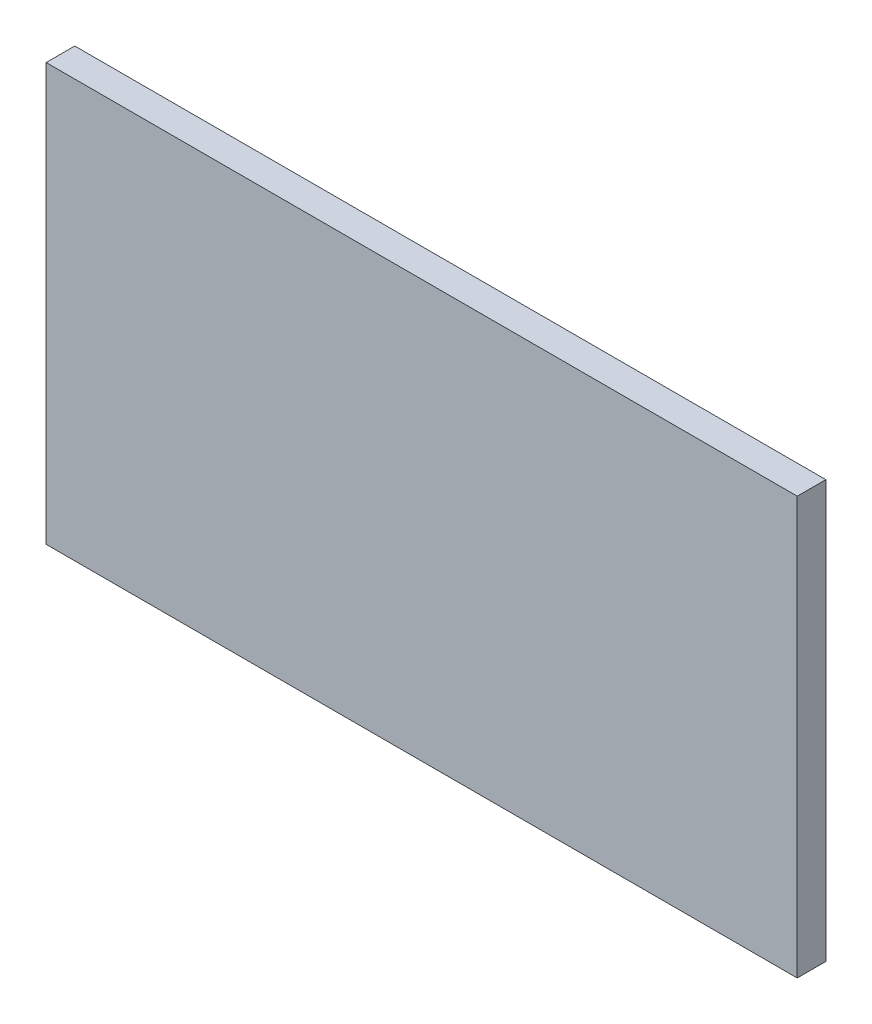
ISO-10303-21;
HEADER;
FILE_DESCRIPTION(('STEP AP214'),'2;1');
FILE_NAME('part.step','',(''),(''),'','','');
FILE_SCHEMA(('AUTOMOTIVE_DESIGN { 1 0 10303 214 1 1 1 1 }'));
ENDSEC;
DATA;
#1=APPLICATION_CONTEXT('core data for automotive mechanical design processes');
#2=APPLICATION_PROTOCOL_DEFINITION('international standard','automotive_design',2000,#1);
#3=PRODUCT_CONTEXT('',#1,'mechanical');
#4=PRODUCT('Part','Part','',(#3));
#5=PRODUCT_RELATED_PRODUCT_CATEGORY('part','',(#4));
#6=PRODUCT_DEFINITION_FORMATION('','',#4);
#7=PRODUCT_DEFINITION_CONTEXT('part definition',#1,'design');
#8=PRODUCT_DEFINITION('design','',#6,#7);
#9=PRODUCT_DEFINITION_SHAPE('','',#8);
#10=(LENGTH_UNIT() NAMED_UNIT(*) SI_UNIT(.MILLI.,.METRE.));
#11=(NAMED_UNIT(*) PLANE_ANGLE_UNIT() SI_UNIT($,.RADIAN.));
#12=(NAMED_UNIT(*) SI_UNIT($,.STERADIAN.) SOLID_ANGLE_UNIT());
#13=UNCERTAINTY_MEASURE_WITH_UNIT(LENGTH_MEASURE(1.E-05),#10,'distance_accuracy_value','');
#14=(GEOMETRIC_REPRESENTATION_CONTEXT(3) GLOBAL_UNCERTAINTY_ASSIGNED_CONTEXT((#13)) GLOBAL_UNIT_ASSIGNED_CONTEXT((#10,
#11,#12)) REPRESENTATION_CONTEXT('',''));
#15=CARTESIAN_POINT('',(0.,0.,0.));
#16=DIRECTION('',(0.,0.,1.));
#17=DIRECTION('',(1.,0.,0.));
#18=AXIS2_PLACEMENT_3D('',#15,#16,#17);
#19=CARTESIAN_POINT('',(0.70008,5.6,0.));
#20=DIRECTION('',(0.,0.,-1.));
#21=DIRECTION('',(-1.,0.,0.));
#22=AXIS2_PLACEMENT_3D('',#19,#20,#21);
#23=PLANE('',#22);
#24=DIRECTION('',(1.,0.,0.));
#25=VECTOR('',#24,1.);
#26=CARTESIAN_POINT('',(0.25008,5.85,0.));
#27=LINE('',#26,#25);
#28=CARTESIAN_POINT('',(0.25008,5.85,0.));
#29=VERTEX_POINT('',#28);
#30=CARTESIAN_POINT('',(1.15008,5.85,0.));
#31=VERTEX_POINT('',#30);
#32=EDGE_CURVE('E55',#29,#31,#27,.T.);
#33=ORIENTED_EDGE('',*,*,#32,.T.);
#34=DIRECTION('',(0.,1.,0.));
#35=VECTOR('',#34,1.);
#36=CARTESIAN_POINT('',(1.15008,5.85,0.));
#37=LINE('',#36,#35);
#38=CARTESIAN_POINT('',(1.15008,5.35,0.));
#39=VERTEX_POINT('',#38);
#40=EDGE_CURVE('E57',#31,#39,#37,.F.);
#41=ORIENTED_EDGE('',*,*,#40,.T.);
#42=DIRECTION('',(1.,0.,0.));
#43=VECTOR('',#42,1.);
#44=CARTESIAN_POINT('',(1.15008,5.35,0.));
#45=LINE('',#44,#43);
#46=CARTESIAN_POINT('',(0.25008,5.35,0.));
#47=VERTEX_POINT('',#46);
#48=EDGE_CURVE('E20',#39,#47,#45,.F.);
#49=ORIENTED_EDGE('',*,*,#48,.T.);
#50=DIRECTION('',(0.,1.,0.));
#51=VECTOR('',#50,1.);
#52=CARTESIAN_POINT('',(0.25008,5.35,0.));
#53=LINE('',#52,#51);
#54=EDGE_CURVE('E80',#47,#29,#53,.T.);
#55=ORIENTED_EDGE('',*,*,#54,.T.);
#56=EDGE_LOOP('',(#33,#41,#49,#55));
#57=FACE_BOUND('',#56,.T.);
#58=ADVANCED_FACE('F17',(#57),#23,.T.);
#59=CARTESIAN_POINT('',(1.15008,5.35,0.));
#60=DIRECTION('',(0.,1.,0.));
#61=DIRECTION('',(0.,0.,1.));
#62=AXIS2_PLACEMENT_3D('',#59,#60,#61);
#63=PLANE('',#62);
#64=DIRECTION('',(0.,0.,-1.));
#65=VECTOR('',#64,1.);
#66=CARTESIAN_POINT('',(0.25008,5.35,0.));
#67=LINE('',#66,#65);
#68=CARTESIAN_POINT('',(0.25008,5.35,0.03429));
#69=VERTEX_POINT('',#68);
#70=EDGE_CURVE('E68',#69,#47,#67,.T.);
#71=ORIENTED_EDGE('',*,*,#70,.T.);
#72=ORIENTED_EDGE('',*,*,#48,.F.);
#73=DIRECTION('',(0.,0.,1.));
#74=VECTOR('',#73,1.);
#75=CARTESIAN_POINT('',(1.15008,5.35,0.));
#76=LINE('',#75,#74);
#77=CARTESIAN_POINT('',(1.15008,5.35,0.03429));
#78=VERTEX_POINT('',#77);
#79=EDGE_CURVE('E63',#39,#78,#76,.T.);
#80=ORIENTED_EDGE('',*,*,#79,.T.);
#81=DIRECTION('',(1.,0.,0.));
#82=VECTOR('',#81,1.);
#83=CARTESIAN_POINT('',(0.70008,5.35,0.03429));
#84=LINE('',#83,#82);
#85=EDGE_CURVE('E83',#69,#78,#84,.T.);
#86=ORIENTED_EDGE('',*,*,#85,.F.);
#87=EDGE_LOOP('',(#71,#72,#80,#86));
#88=FACE_BOUND('',#87,.T.);
#89=ADVANCED_FACE('F65',(#88),#63,.F.);
#90=CARTESIAN_POINT('',(1.15008,5.85,0.));
#91=DIRECTION('',(-1.,0.,0.));
#92=DIRECTION('',(0.,0.,1.));
#93=AXIS2_PLACEMENT_3D('',#90,#91,#92);
#94=PLANE('',#93);
#95=ORIENTED_EDGE('',*,*,#79,.F.);
#96=ORIENTED_EDGE('',*,*,#40,.F.);
#97=DIRECTION('',(0.,0.,-1.));
#98=VECTOR('',#97,1.);
#99=CARTESIAN_POINT('',(1.15008,5.85,0.));
#100=LINE('',#99,#98);
#101=CARTESIAN_POINT('',(1.15008,5.85,0.03429));
#102=VERTEX_POINT('',#101);
#103=EDGE_CURVE('E75',#31,#102,#100,.F.);
#104=ORIENTED_EDGE('',*,*,#103,.T.);
#105=DIRECTION('',(0.,1.,0.));
#106=VECTOR('',#105,1.);
#107=CARTESIAN_POINT('',(1.15008,5.6,0.03429));
#108=LINE('',#107,#106);
#109=EDGE_CURVE('E72',#78,#102,#108,.T.);
#110=ORIENTED_EDGE('',*,*,#109,.F.);
#111=EDGE_LOOP('',(#95,#96,#104,#110));
#112=FACE_BOUND('',#111,.T.);
#113=ADVANCED_FACE('F70',(#112),#94,.F.);
#114=CARTESIAN_POINT('',(0.25008,5.85,0.));
#115=DIRECTION('',(0.,-1.,0.));
#116=DIRECTION('',(0.,0.,-1.));
#117=AXIS2_PLACEMENT_3D('',#114,#115,#116);
#118=PLANE('',#117);
#119=ORIENTED_EDGE('',*,*,#103,.F.);
#120=ORIENTED_EDGE('',*,*,#32,.F.);
#121=DIRECTION('',(0.,0.,-1.));
#122=VECTOR('',#121,1.);
#123=CARTESIAN_POINT('',(0.25008,5.85,0.));
#124=LINE('',#123,#122);
#125=CARTESIAN_POINT('',(0.25008,5.85,0.03429));
#126=VERTEX_POINT('',#125);
#127=EDGE_CURVE('E35',#29,#126,#124,.F.);
#128=ORIENTED_EDGE('',*,*,#127,.T.);
#129=DIRECTION('',(1.,0.,0.));
#130=VECTOR('',#129,1.);
#131=CARTESIAN_POINT('',(0.70008,5.85,0.03429));
#132=LINE('',#131,#130);
#133=EDGE_CURVE('E26',#102,#126,#132,.F.);
#134=ORIENTED_EDGE('',*,*,#133,.F.);
#135=EDGE_LOOP('',(#119,#120,#128,#134));
#136=FACE_BOUND('',#135,.T.);
#137=ADVANCED_FACE('F89',(#136),#118,.F.);
#138=CARTESIAN_POINT('',(0.25008,5.35,0.));
#139=DIRECTION('',(1.,0.,0.));
#140=DIRECTION('',(0.,0.,-1.));
#141=AXIS2_PLACEMENT_3D('',#138,#139,#140);
#142=PLANE('',#141);
#143=ORIENTED_EDGE('',*,*,#127,.F.);
#144=ORIENTED_EDGE('',*,*,#54,.F.);
#145=ORIENTED_EDGE('',*,*,#70,.F.);
#146=DIRECTION('',(0.,1.,0.));
#147=VECTOR('',#146,1.);
#148=CARTESIAN_POINT('',(0.25008,5.6,0.03429));
#149=LINE('',#148,#147);
#150=EDGE_CURVE('E11',#126,#69,#149,.F.);
#151=ORIENTED_EDGE('',*,*,#150,.F.);
#152=EDGE_LOOP('',(#143,#144,#145,#151));
#153=FACE_BOUND('',#152,.T.);
#154=ADVANCED_FACE('F91',(#153),#142,.F.);
#155=CARTESIAN_POINT('',(0.70008,5.6,0.03429));
#156=DIRECTION('',(0.,0.,1.));
#157=DIRECTION('',(1.,0.,0.));
#158=AXIS2_PLACEMENT_3D('',#155,#156,#157);
#159=PLANE('',#158);
#160=ORIENTED_EDGE('',*,*,#133,.T.);
#161=ORIENTED_EDGE('',*,*,#150,.T.);
#162=ORIENTED_EDGE('',*,*,#85,.T.);
#163=ORIENTED_EDGE('',*,*,#109,.T.);
#164=EDGE_LOOP('',(#160,#161,#162,#163));
#165=FACE_BOUND('',#164,.T.);
#166=ADVANCED_FACE('F88',(#165),#159,.T.);
#167=CLOSED_SHELL('',(#58,#89,#113,#137,#154,#166));
#168=MANIFOLD_SOLID_BREP('B1',#167);
#169=ADVANCED_BREP_SHAPE_REPRESENTATION('',(#18,#168),#14);
#170=SHAPE_DEFINITION_REPRESENTATION(#9,#169);
ENDSEC;
END-ISO-10303-21;
